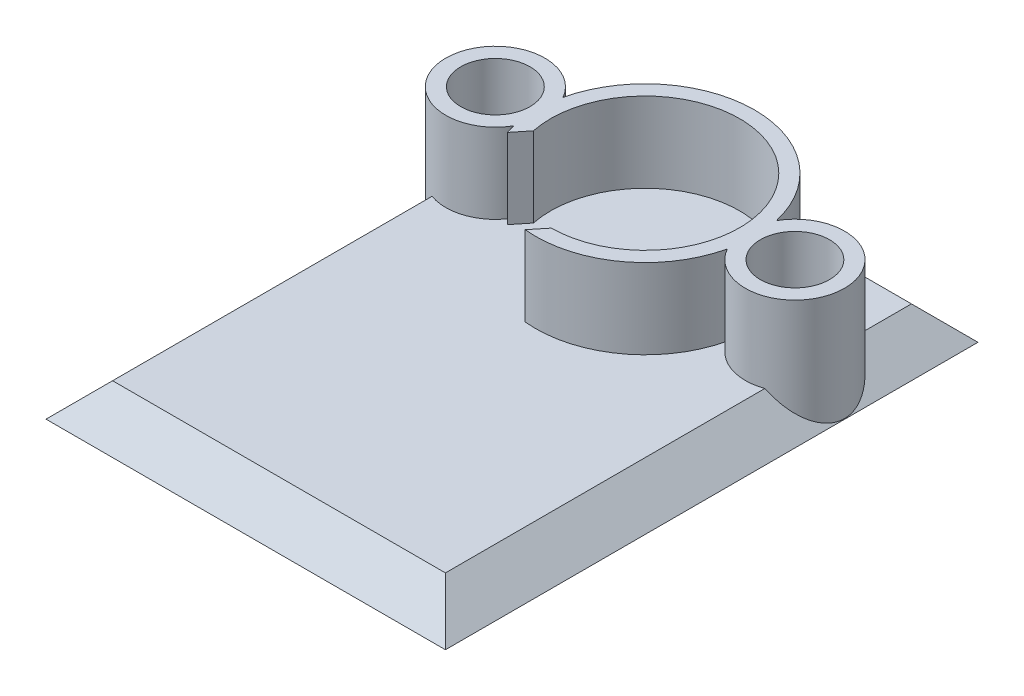
ISO-10303-21;
HEADER;
FILE_DESCRIPTION(('STEP AP214'),'2;1');
FILE_NAME('part.step','',(''),(''),'','','');
FILE_SCHEMA(('AUTOMOTIVE_DESIGN { 1 0 10303 214 1 1 1 1 }'));
ENDSEC;
DATA;
#1=APPLICATION_CONTEXT('core data for automotive mechanical design processes');
#2=APPLICATION_PROTOCOL_DEFINITION('international standard','automotive_design',2000,#1);
#3=PRODUCT_CONTEXT('',#1,'mechanical');
#4=PRODUCT('Part','Part','',(#3));
#5=PRODUCT_RELATED_PRODUCT_CATEGORY('part','',(#4));
#6=PRODUCT_DEFINITION_FORMATION('','',#4);
#7=PRODUCT_DEFINITION_CONTEXT('part definition',#1,'design');
#8=PRODUCT_DEFINITION('design','',#6,#7);
#9=PRODUCT_DEFINITION_SHAPE('','',#8);
#10=(LENGTH_UNIT() NAMED_UNIT(*) SI_UNIT(.MILLI.,.METRE.));
#11=(NAMED_UNIT(*) PLANE_ANGLE_UNIT() SI_UNIT($,.RADIAN.));
#12=(NAMED_UNIT(*) SI_UNIT($,.STERADIAN.) SOLID_ANGLE_UNIT());
#13=UNCERTAINTY_MEASURE_WITH_UNIT(LENGTH_MEASURE(1.E-05),#10,'distance_accuracy_value','');
#14=(GEOMETRIC_REPRESENTATION_CONTEXT(3) GLOBAL_UNCERTAINTY_ASSIGNED_CONTEXT((#13)) GLOBAL_UNIT_ASSIGNED_CONTEXT((#10,
#11,#12)) REPRESENTATION_CONTEXT('',''));
#15=CARTESIAN_POINT('',(0.,0.,0.));
#16=DIRECTION('',(0.,0.,1.));
#17=DIRECTION('',(1.,0.,0.));
#18=AXIS2_PLACEMENT_3D('',#15,#16,#17);
#19=CARTESIAN_POINT('',(0.,0.,0.));
#20=DIRECTION('',(0.,-1.,0.));
#21=DIRECTION('',(0.,0.,-1.));
#22=AXIS2_PLACEMENT_3D('',#19,#20,#21);
#23=PLANE('',#22);
#24=DIRECTION('',(0.,0.,-1.));
#25=VECTOR('',#24,1.);
#26=CARTESIAN_POINT('',(25.,0.,-40.));
#27=LINE('',#26,#25);
#28=CARTESIAN_POINT('',(25.,0.,-27.0180125391738));
#29=VERTEX_POINT('',#28);
#30=CARTESIAN_POINT('',(25.,0.,-35.));
#31=VERTEX_POINT('',#30);
#32=EDGE_CURVE('E55',#29,#31,#27,.T.);
#33=ORIENTED_EDGE('',*,*,#32,.T.);
#34=DIRECTION('',(-1.,0.,0.));
#35=VECTOR('',#34,1.);
#36=CARTESIAN_POINT('',(0.,0.,-35.));
#37=LINE('',#36,#35);
#38=CARTESIAN_POINT('',(6.7529623129409,0.,-35.));
#39=VERTEX_POINT('',#38);
#40=EDGE_CURVE('E205',#31,#39,#37,.T.);
#41=ORIENTED_EDGE('',*,*,#40,.T.);
#42=CARTESIAN_POINT('',(0.,0.,-20.));
#43=DIRECTION('',(0.,1.,0.));
#44=DIRECTION('',(0.,0.,1.));
#45=AXIS2_PLACEMENT_3D('',#42,#43,#44);
#46=CIRCLE('',#45,16.45);
#47=CARTESIAN_POINT('',(16.03,0.,-23.6934536683164));
#48=VERTEX_POINT('',#47);
#49=EDGE_CURVE('E247',#48,#39,#46,.T.);
#50=ORIENTED_EDGE('',*,*,#49,.F.);
#51=CARTESIAN_POINT('',(22.5,0.,-20.));
#52=DIRECTION('',(0.,1.,0.));
#53=DIRECTION('',(0.,0.,1.));
#54=AXIS2_PLACEMENT_3D('',#51,#52,#53);
#55=CIRCLE('',#54,7.45);
#56=EDGE_CURVE('E243',#29,#48,#55,.T.);
#57=ORIENTED_EDGE('',*,*,#56,.F.);
#58=EDGE_LOOP('',(#33,#41,#50,#57));
#59=FACE_BOUND('',#58,.T.);
#60=ADVANCED_FACE('F38',(#59),#23,.F.);
#61=CARTESIAN_POINT('',(-6.75296231294093,0.,-35.));
#62=VERTEX_POINT('',#61);
#63=CARTESIAN_POINT('',(-16.03,0.,-23.6934536683164));
#64=VERTEX_POINT('',#63);
#65=EDGE_CURVE('E233',#62,#64,#46,.T.);
#66=ORIENTED_EDGE('',*,*,#65,.F.);
#67=DIRECTION('',(-1.,0.,0.));
#68=VECTOR('',#67,1.);
#69=CARTESIAN_POINT('',(0.,0.,-35.));
#70=LINE('',#69,#68);
#71=CARTESIAN_POINT('',(-25.,0.,-35.));
#72=VERTEX_POINT('',#71);
#73=EDGE_CURVE('E63',#62,#72,#70,.T.);
#74=ORIENTED_EDGE('',*,*,#73,.T.);
#75=DIRECTION('',(0.,0.,1.));
#76=VECTOR('',#75,1.);
#77=CARTESIAN_POINT('',(-25.,0.,0.));
#78=LINE('',#77,#76);
#79=CARTESIAN_POINT('',(-25.,0.,-27.0180125391738));
#80=VERTEX_POINT('',#79);
#81=EDGE_CURVE('E201',#72,#80,#78,.T.);
#82=ORIENTED_EDGE('',*,*,#81,.T.);
#83=CARTESIAN_POINT('',(-22.5,0.,-20.));
#84=DIRECTION('',(0.,1.,0.));
#85=DIRECTION('',(0.,0.,1.));
#86=AXIS2_PLACEMENT_3D('',#83,#84,#85);
#87=CIRCLE('',#86,7.45);
#88=EDGE_CURVE('E224',#64,#80,#87,.T.);
#89=ORIENTED_EDGE('',*,*,#88,.F.);
#90=EDGE_LOOP('',(#66,#74,#82,#89));
#91=FACE_BOUND('',#90,.T.);
#92=ADVANCED_FACE('F316',(#91),#23,.F.);
#93=CARTESIAN_POINT('',(0.,-4.99999999999999,0.));
#94=DIRECTION('',(0.,-1.,0.));
#95=DIRECTION('',(0.,0.,-1.));
#96=AXIS2_PLACEMENT_3D('',#93,#94,#95);
#97=PLANE('',#96);
#98=DIRECTION('',(0.,0.,-1.));
#99=VECTOR('',#98,1.);
#100=CARTESIAN_POINT('',(-30.,-4.99999999999999,40.));
#101=LINE('',#100,#99);
#102=CARTESIAN_POINT('',(-30.,-4.99999999999999,40.));
#103=VERTEX_POINT('',#102);
#104=CARTESIAN_POINT('',(-30.,-4.99999999999999,-40.));
#105=VERTEX_POINT('',#104);
#106=EDGE_CURVE('E179',#103,#105,#101,.T.);
#107=ORIENTED_EDGE('',*,*,#106,.T.);
#108=DIRECTION('',(1.,0.,0.));
#109=VECTOR('',#108,1.);
#110=CARTESIAN_POINT('',(-30.,-4.99999999999999,-40.));
#111=LINE('',#110,#109);
#112=CARTESIAN_POINT('',(30.,-4.99999999999999,-40.));
#113=VERTEX_POINT('',#112);
#114=EDGE_CURVE('E181',#105,#113,#111,.T.);
#115=ORIENTED_EDGE('',*,*,#114,.T.);
#116=DIRECTION('',(0.,0.,-1.));
#117=VECTOR('',#116,1.);
#118=CARTESIAN_POINT('',(30.,-4.99999999999999,40.));
#119=LINE('',#118,#117);
#120=CARTESIAN_POINT('',(30.,-4.99999999999999,40.));
#121=VERTEX_POINT('',#120);
#122=EDGE_CURVE('E189',#121,#113,#119,.T.);
#123=ORIENTED_EDGE('',*,*,#122,.F.);
#124=DIRECTION('',(1.,0.,0.));
#125=VECTOR('',#124,1.);
#126=CARTESIAN_POINT('',(-30.,-4.99999999999999,40.));
#127=LINE('',#126,#125);
#128=EDGE_CURVE('E192',#103,#121,#127,.T.);
#129=ORIENTED_EDGE('',*,*,#128,.F.);
#130=EDGE_LOOP('',(#107,#115,#123,#129));
#131=FACE_BOUND('',#130,.T.);
#132=ADVANCED_FACE('F318',(#131),#97,.T.);
#133=DIRECTION('',(1.,0.,0.));
#134=VECTOR('',#133,1.);
#135=CARTESIAN_POINT('',(30.,0.,35.));
#136=LINE('',#135,#134);
#137=CARTESIAN_POINT('',(-25.,0.,35.));
#138=VERTEX_POINT('',#137);
#139=CARTESIAN_POINT('',(25.,0.,35.));
#140=VERTEX_POINT('',#139);
#141=EDGE_CURVE('E197',#138,#140,#136,.T.);
#142=ORIENTED_EDGE('',*,*,#141,.T.);
#143=DIRECTION('',(0.,0.,-1.));
#144=VECTOR('',#143,1.);
#145=CARTESIAN_POINT('',(25.,0.,-40.));
#146=LINE('',#145,#144);
#147=CARTESIAN_POINT('',(25.,0.,-12.9819874608263));
#148=VERTEX_POINT('',#147);
#149=EDGE_CURVE('E199',#140,#148,#146,.T.);
#150=ORIENTED_EDGE('',*,*,#149,.T.);
#151=CARTESIAN_POINT('',(16.03,0.,-16.3065463316836));
#152=VERTEX_POINT('',#151);
#153=EDGE_CURVE('E240',#152,#148,#55,.T.);
#154=ORIENTED_EDGE('',*,*,#153,.F.);
#155=CARTESIAN_POINT('',(-1.65953563684607,0.,-3.63392406622652));
#156=VERTEX_POINT('',#155);
#157=EDGE_CURVE('E234',#156,#152,#46,.T.);
#158=ORIENTED_EDGE('',*,*,#157,.F.);
#159=DIRECTION('',(0.628766779390763,0.,-0.777593941035144));
#160=VECTOR('',#159,1.);
#161=CARTESIAN_POINT('',(-2.78015929025246,0.,-2.24805224279177));
#162=LINE('',#161,#160);
#163=CARTESIAN_POINT('',(0.092207471268051,0.,-5.80029937702053));
#164=VERTEX_POINT('',#163);
#165=EDGE_CURVE('E238',#156,#164,#162,.T.);
#166=ORIENTED_EDGE('',*,*,#165,.T.);
#167=CARTESIAN_POINT('',(0.,0.,-20.));
#168=DIRECTION('',(0.,1.,0.));
#169=DIRECTION('',(0.,0.,1.));
#170=AXIS2_PLACEMENT_3D('',#167,#168,#169);
#171=CIRCLE('',#170,14.2);
#172=CARTESIAN_POINT('',(-13.9044834673646,0.,-17.1181014060543));
#173=VERTEX_POINT('',#172);
#174=EDGE_CURVE('E236',#164,#173,#171,.T.);
#175=ORIENTED_EDGE('',*,*,#174,.T.);
#176=DIRECTION('',(-0.628766779390764,0.,0.777593941035144));
#177=VECTOR('',#176,1.);
#178=CARTESIAN_POINT('',(-16.7768502288851,0.,-13.5658542718256));
#179=LINE('',#178,#177);
#180=CARTESIAN_POINT('',(-15.6562265754787,0.,-14.9517260952603));
#181=VERTEX_POINT('',#180);
#182=EDGE_CURVE('E232',#173,#181,#179,.T.);
#183=ORIENTED_EDGE('',*,*,#182,.T.);
#184=CARTESIAN_POINT('',(-16.03,0.,-16.3065463316836));
#185=VERTEX_POINT('',#184);
#186=EDGE_CURVE('E226',#185,#181,#46,.T.);
#187=ORIENTED_EDGE('',*,*,#186,.F.);
#188=CARTESIAN_POINT('',(-25.,0.,-12.9819874608262));
#189=VERTEX_POINT('',#188);
#190=EDGE_CURVE('E177',#189,#185,#87,.T.);
#191=ORIENTED_EDGE('',*,*,#190,.F.);
#192=DIRECTION('',(0.,0.,1.));
#193=VECTOR('',#192,1.);
#194=CARTESIAN_POINT('',(-25.,0.,0.));
#195=LINE('',#194,#193);
#196=EDGE_CURVE('E195',#189,#138,#195,.T.);
#197=ORIENTED_EDGE('',*,*,#196,.T.);
#198=EDGE_LOOP('',(#142,#150,#154,#158,#166,#175,#183,#187,#191,#197));
#199=FACE_BOUND('',#198,.T.);
#200=ADVANCED_FACE('F274',(#199),#23,.F.);
#201=CARTESIAN_POINT('',(-22.5,12.,-20.));
#202=DIRECTION('',(0.,-1.,0.));
#203=DIRECTION('',(0.,0.,-1.));
#204=AXIS2_PLACEMENT_3D('',#201,#202,#203);
#205=CYLINDRICAL_SURFACE('',#204,7.45);
#206=ORIENTED_EDGE('',*,*,#88,.T.);
#207=CARTESIAN_POINT('',(-22.5,2.49999999999997,-20.));
#208=DIRECTION('',(0.707106781186546,-0.707106781186549,0.));
#209=DIRECTION('',(-0.707106781186549,-0.707106781186546,0.));
#210=AXIS2_PLACEMENT_3D('',#207,#208,#209);
#211=ELLIPSE('',#210,10.5358910396795,7.45);
#212=EDGE_CURVE('E11',#80,#189,#211,.F.);
#213=ORIENTED_EDGE('',*,*,#212,.T.);
#214=ORIENTED_EDGE('',*,*,#190,.T.);
#215=DIRECTION('',(0.,-1.,0.));
#216=VECTOR('',#215,1.);
#217=CARTESIAN_POINT('',(-16.03,12.,-16.3065463316836));
#218=LINE('',#217,#216);
#219=CARTESIAN_POINT('',(-16.03,12.,-16.3065463316836));
#220=VERTEX_POINT('',#219);
#221=EDGE_CURVE('E154',#220,#185,#218,.T.);
#222=ORIENTED_EDGE('',*,*,#221,.F.);
#223=CARTESIAN_POINT('',(-22.5,12.,-20.));
#224=DIRECTION('',(0.,1.,0.));
#225=DIRECTION('',(0.,0.,1.));
#226=AXIS2_PLACEMENT_3D('',#223,#224,#225);
#227=CIRCLE('',#226,7.45);
#228=CARTESIAN_POINT('',(-16.03,12.,-23.6934536683164));
#229=VERTEX_POINT('',#228);
#230=EDGE_CURVE('E161',#229,#220,#227,.T.);
#231=ORIENTED_EDGE('',*,*,#230,.F.);
#232=DIRECTION('',(0.,-1.,0.));
#233=VECTOR('',#232,1.);
#234=CARTESIAN_POINT('',(-16.03,12.,-23.6934536683164));
#235=LINE('',#234,#233);
#236=EDGE_CURVE('E250',#229,#64,#235,.T.);
#237=ORIENTED_EDGE('',*,*,#236,.T.);
#238=EDGE_LOOP('',(#206,#213,#214,#222,#231,#237));
#239=FACE_BOUND('',#238,.T.);
#240=ADVANCED_FACE('F175',(#239),#205,.T.);
#241=CARTESIAN_POINT('',(0.,12.,-20.));
#242=DIRECTION('',(0.,-1.,0.));
#243=DIRECTION('',(0.,0.,-1.));
#244=AXIS2_PLACEMENT_3D('',#241,#242,#243);
#245=CYLINDRICAL_SURFACE('',#244,16.45);
#246=ORIENTED_EDGE('',*,*,#186,.T.);
#247=DIRECTION('',(0.,-1.,0.));
#248=VECTOR('',#247,1.);
#249=CARTESIAN_POINT('',(-15.6562265754787,12.,-14.9517260952603));
#250=LINE('',#249,#248);
#251=CARTESIAN_POINT('',(-15.6562265754787,12.,-14.9517260952603));
#252=VERTEX_POINT('',#251);
#253=EDGE_CURVE('E156',#252,#181,#250,.T.);
#254=ORIENTED_EDGE('',*,*,#253,.F.);
#255=CARTESIAN_POINT('',(0.,12.,-20.));
#256=DIRECTION('',(0.,1.,0.));
#257=DIRECTION('',(0.,0.,1.));
#258=AXIS2_PLACEMENT_3D('',#255,#256,#257);
#259=CIRCLE('',#258,16.45);
#260=EDGE_CURVE('E149',#220,#252,#259,.T.);
#261=ORIENTED_EDGE('',*,*,#260,.F.);
#262=ORIENTED_EDGE('',*,*,#221,.T.);
#263=EDGE_LOOP('',(#246,#254,#261,#262));
#264=FACE_BOUND('',#263,.T.);
#265=ADVANCED_FACE('F152',(#264),#245,.T.);
#266=CARTESIAN_POINT('',(-16.7768502288851,12.,-13.5658542718256));
#267=DIRECTION('',(0.777593941035144,0.,0.628766779390764));
#268=DIRECTION('',(0.628766779390764,0.,-0.777593941035144));
#269=AXIS2_PLACEMENT_3D('',#266,#267,#268);
#270=PLANE('',#269);
#271=ORIENTED_EDGE('',*,*,#182,.F.);
#272=DIRECTION('',(0.,-1.,0.));
#273=VECTOR('',#272,1.);
#274=CARTESIAN_POINT('',(-13.9044834673646,12.,-17.1181014060543));
#275=LINE('',#274,#273);
#276=CARTESIAN_POINT('',(-13.9044834673646,12.,-17.1181014060543));
#277=VERTEX_POINT('',#276);
#278=EDGE_CURVE('E183',#277,#173,#275,.T.);
#279=ORIENTED_EDGE('',*,*,#278,.F.);
#280=DIRECTION('',(-0.628766779390764,0.,0.777593941035144));
#281=VECTOR('',#280,1.);
#282=CARTESIAN_POINT('',(-16.7768502288851,12.,-13.5658542718256));
#283=LINE('',#282,#281);
#284=EDGE_CURVE('E160',#277,#252,#283,.T.);
#285=ORIENTED_EDGE('',*,*,#284,.T.);
#286=ORIENTED_EDGE('',*,*,#253,.T.);
#287=EDGE_LOOP('',(#271,#279,#285,#286));
#288=FACE_BOUND('',#287,.T.);
#289=ADVANCED_FACE('F272',(#288),#270,.T.);
#290=CARTESIAN_POINT('',(0.,12.,-20.));
#291=DIRECTION('',(0.,-1.,0.));
#292=DIRECTION('',(0.,0.,-1.));
#293=AXIS2_PLACEMENT_3D('',#290,#291,#292);
#294=CYLINDRICAL_SURFACE('',#293,14.2);
#295=ORIENTED_EDGE('',*,*,#174,.F.);
#296=DIRECTION('',(0.,-1.,0.));
#297=VECTOR('',#296,1.);
#298=CARTESIAN_POINT('',(0.092207471268051,12.,-5.80029937702053));
#299=LINE('',#298,#297);
#300=CARTESIAN_POINT('',(0.092207471268051,12.,-5.80029937702053));
#301=VERTEX_POINT('',#300);
#302=EDGE_CURVE('E261',#301,#164,#299,.T.);
#303=ORIENTED_EDGE('',*,*,#302,.F.);
#304=CARTESIAN_POINT('',(0.,12.,-20.));
#305=DIRECTION('',(0.,1.,0.));
#306=DIRECTION('',(0.,0.,1.));
#307=AXIS2_PLACEMENT_3D('',#304,#305,#306);
#308=CIRCLE('',#307,14.2);
#309=EDGE_CURVE('E270',#301,#277,#308,.T.);
#310=ORIENTED_EDGE('',*,*,#309,.T.);
#311=ORIENTED_EDGE('',*,*,#278,.T.);
#312=EDGE_LOOP('',(#295,#303,#310,#311));
#313=FACE_BOUND('',#312,.T.);
#314=ADVANCED_FACE('F268',(#313),#294,.F.);
#315=CARTESIAN_POINT('',(-2.78015929025246,12.,-2.24805224279177));
#316=DIRECTION('',(-0.777593941035144,0.,-0.628766779390763));
#317=DIRECTION('',(-0.628766779390763,0.,0.777593941035144));
#318=AXIS2_PLACEMENT_3D('',#315,#316,#317);
#319=PLANE('',#318);
#320=ORIENTED_EDGE('',*,*,#165,.F.);
#321=DIRECTION('',(0.,-1.,0.));
#322=VECTOR('',#321,1.);
#323=CARTESIAN_POINT('',(-1.65953563684607,12.,-3.63392406622652));
#324=LINE('',#323,#322);
#325=CARTESIAN_POINT('',(-1.65953563684607,12.,-3.63392406622652));
#326=VERTEX_POINT('',#325);
#327=EDGE_CURVE('E258',#326,#156,#324,.T.);
#328=ORIENTED_EDGE('',*,*,#327,.F.);
#329=DIRECTION('',(0.628766779390763,0.,-0.777593941035144));
#330=VECTOR('',#329,1.);
#331=CARTESIAN_POINT('',(-2.78015929025246,12.,-2.24805224279177));
#332=LINE('',#331,#330);
#333=EDGE_CURVE('E281',#326,#301,#332,.T.);
#334=ORIENTED_EDGE('',*,*,#333,.T.);
#335=ORIENTED_EDGE('',*,*,#302,.T.);
#336=EDGE_LOOP('',(#320,#328,#334,#335));
#337=FACE_BOUND('',#336,.T.);
#338=ADVANCED_FACE('F279',(#337),#319,.T.);
#339=ORIENTED_EDGE('',*,*,#157,.T.);
#340=DIRECTION('',(0.,-1.,0.));
#341=VECTOR('',#340,1.);
#342=CARTESIAN_POINT('',(16.03,12.,-16.3065463316836));
#343=LINE('',#342,#341);
#344=CARTESIAN_POINT('',(16.03,12.,-16.3065463316836));
#345=VERTEX_POINT('',#344);
#346=EDGE_CURVE('E255',#345,#152,#343,.T.);
#347=ORIENTED_EDGE('',*,*,#346,.F.);
#348=EDGE_CURVE('E164',#326,#345,#259,.T.);
#349=ORIENTED_EDGE('',*,*,#348,.F.);
#350=ORIENTED_EDGE('',*,*,#327,.T.);
#351=EDGE_LOOP('',(#339,#347,#349,#350));
#352=FACE_BOUND('',#351,.T.);
#353=ADVANCED_FACE('F297',(#352),#245,.T.);
#354=CARTESIAN_POINT('',(22.5,12.,-20.));
#355=DIRECTION('',(0.,-1.,0.));
#356=DIRECTION('',(0.,0.,-1.));
#357=AXIS2_PLACEMENT_3D('',#354,#355,#356);
#358=CYLINDRICAL_SURFACE('',#357,7.45);
#359=ORIENTED_EDGE('',*,*,#153,.T.);
#360=CARTESIAN_POINT('',(22.5,2.5,-20.));
#361=DIRECTION('',(0.707106781186546,0.707106781186549,0.));
#362=DIRECTION('',(0.707106781186549,-0.707106781186546,0.));
#363=AXIS2_PLACEMENT_3D('',#360,#361,#362);
#364=ELLIPSE('',#363,10.5358910396795,7.45);
#365=EDGE_CURVE('E47',#148,#29,#364,.T.);
#366=ORIENTED_EDGE('',*,*,#365,.T.);
#367=ORIENTED_EDGE('',*,*,#56,.T.);
#368=DIRECTION('',(0.,-1.,0.));
#369=VECTOR('',#368,1.);
#370=CARTESIAN_POINT('',(16.03,12.,-23.6934536683164));
#371=LINE('',#370,#369);
#372=CARTESIAN_POINT('',(16.03,12.,-23.6934536683164));
#373=VERTEX_POINT('',#372);
#374=EDGE_CURVE('E252',#373,#48,#371,.T.);
#375=ORIENTED_EDGE('',*,*,#374,.F.);
#376=CARTESIAN_POINT('',(22.5,12.,-20.));
#377=DIRECTION('',(0.,1.,0.));
#378=DIRECTION('',(0.,0.,1.));
#379=AXIS2_PLACEMENT_3D('',#376,#377,#378);
#380=CIRCLE('',#379,7.45);
#381=EDGE_CURVE('E286',#345,#373,#380,.T.);
#382=ORIENTED_EDGE('',*,*,#381,.F.);
#383=ORIENTED_EDGE('',*,*,#346,.T.);
#384=EDGE_LOOP('',(#359,#366,#367,#375,#382,#383));
#385=FACE_BOUND('',#384,.T.);
#386=ADVANCED_FACE('F299',(#385),#358,.T.);
#387=CARTESIAN_POINT('',(-22.5,12.,-20.));
#388=DIRECTION('',(0.,-1.,0.));
#389=DIRECTION('',(0.,0.,-1.));
#390=AXIS2_PLACEMENT_3D('',#387,#388,#389);
#391=CYLINDRICAL_SURFACE('',#390,5.2);
#392=CARTESIAN_POINT('',(-22.5,12.,-20.));
#393=DIRECTION('',(0.,1.,0.));
#394=DIRECTION('',(0.,0.,1.));
#395=AXIS2_PLACEMENT_3D('',#392,#393,#394);
#396=CIRCLE('',#395,5.2);
#397=CARTESIAN_POINT('',(-22.5,12.,-14.8));
#398=VERTEX_POINT('',#397);
#399=EDGE_CURVE('E287',#398,#398,#396,.T.);
#400=ORIENTED_EDGE('',*,*,#399,.T.);
#401=EDGE_LOOP('',(#400));
#402=FACE_BOUND('',#401,.T.);
#403=CARTESIAN_POINT('',(-22.5,0.,-20.));
#404=DIRECTION('',(0.,1.,0.));
#405=DIRECTION('',(0.,0.,1.));
#406=AXIS2_PLACEMENT_3D('',#403,#404,#405);
#407=CIRCLE('',#406,5.2);
#408=CARTESIAN_POINT('',(-22.5,0.,-14.8));
#409=VERTEX_POINT('',#408);
#410=EDGE_CURVE('E244',#409,#409,#407,.T.);
#411=ORIENTED_EDGE('',*,*,#410,.F.);
#412=EDGE_LOOP('',(#411));
#413=FACE_BOUND('',#412,.T.);
#414=ADVANCED_FACE('F359',(#402,#413),#391,.F.);
#415=ORIENTED_EDGE('',*,*,#49,.T.);
#416=CARTESIAN_POINT('',(0.,14.9999999999999,-20.));
#417=DIRECTION('',(0.,-0.707106781186549,0.707106781186546));
#418=DIRECTION('',(0.,-0.707106781186546,-0.707106781186549));
#419=AXIS2_PLACEMENT_3D('',#416,#417,#418);
#420=ELLIPSE('',#419,23.2638131010374,16.45);
#421=EDGE_CURVE('E207',#39,#62,#420,.F.);
#422=ORIENTED_EDGE('',*,*,#421,.T.);
#423=ORIENTED_EDGE('',*,*,#65,.T.);
#424=ORIENTED_EDGE('',*,*,#236,.F.);
#425=EDGE_CURVE('E163',#373,#229,#259,.T.);
#426=ORIENTED_EDGE('',*,*,#425,.F.);
#427=ORIENTED_EDGE('',*,*,#374,.T.);
#428=EDGE_LOOP('',(#415,#422,#423,#424,#426,#427));
#429=FACE_BOUND('',#428,.T.);
#430=ADVANCED_FACE('F303',(#429),#245,.T.);
#431=CARTESIAN_POINT('',(22.5,12.,-20.));
#432=DIRECTION('',(0.,-1.,0.));
#433=DIRECTION('',(0.,0.,-1.));
#434=AXIS2_PLACEMENT_3D('',#431,#432,#433);
#435=CYLINDRICAL_SURFACE('',#434,5.2);
#436=CARTESIAN_POINT('',(22.5,12.,-20.));
#437=DIRECTION('',(0.,1.,0.));
#438=DIRECTION('',(0.,0.,1.));
#439=AXIS2_PLACEMENT_3D('',#436,#437,#438);
#440=CIRCLE('',#439,5.2);
#441=CARTESIAN_POINT('',(22.5,12.,-14.8));
#442=VERTEX_POINT('',#441);
#443=EDGE_CURVE('E229',#442,#442,#440,.T.);
#444=ORIENTED_EDGE('',*,*,#443,.T.);
#445=EDGE_LOOP('',(#444));
#446=FACE_BOUND('',#445,.T.);
#447=CARTESIAN_POINT('',(22.5,0.,-20.));
#448=DIRECTION('',(0.,1.,0.));
#449=DIRECTION('',(0.,0.,1.));
#450=AXIS2_PLACEMENT_3D('',#447,#448,#449);
#451=CIRCLE('',#450,5.2);
#452=CARTESIAN_POINT('',(22.5,0.,-14.8));
#453=VERTEX_POINT('',#452);
#454=EDGE_CURVE('E172',#453,#453,#451,.T.);
#455=ORIENTED_EDGE('',*,*,#454,.F.);
#456=EDGE_LOOP('',(#455));
#457=FACE_BOUND('',#456,.T.);
#458=ADVANCED_FACE('F350',(#446,#457),#435,.F.);
#459=CARTESIAN_POINT('',(0.,12.,0.));
#460=DIRECTION('',(0.,1.,0.));
#461=DIRECTION('',(0.,0.,1.));
#462=AXIS2_PLACEMENT_3D('',#459,#460,#461);
#463=PLANE('',#462);
#464=ORIENTED_EDGE('',*,*,#230,.T.);
#465=ORIENTED_EDGE('',*,*,#260,.T.);
#466=ORIENTED_EDGE('',*,*,#284,.F.);
#467=ORIENTED_EDGE('',*,*,#309,.F.);
#468=ORIENTED_EDGE('',*,*,#333,.F.);
#469=ORIENTED_EDGE('',*,*,#348,.T.);
#470=ORIENTED_EDGE('',*,*,#381,.T.);
#471=ORIENTED_EDGE('',*,*,#425,.T.);
#472=EDGE_LOOP('',(#464,#465,#466,#467,#468,#469,#470,#471));
#473=FACE_BOUND('',#472,.T.);
#474=ORIENTED_EDGE('',*,*,#399,.F.);
#475=EDGE_LOOP('',(#474));
#476=FACE_BOUND('',#475,.T.);
#477=ORIENTED_EDGE('',*,*,#443,.F.);
#478=EDGE_LOOP('',(#477));
#479=FACE_BOUND('',#478,.T.);
#480=ADVANCED_FACE('F166',(#473,#476,#479),#463,.T.);
#481=ORIENTED_EDGE('',*,*,#410,.T.);
#482=EDGE_LOOP('',(#481));
#483=FACE_BOUND('',#482,.T.);
#484=ADVANCED_FACE('F327',(#483),#23,.F.);
#485=ORIENTED_EDGE('',*,*,#454,.T.);
#486=EDGE_LOOP('',(#485));
#487=FACE_BOUND('',#486,.T.);
#488=ADVANCED_FACE('F326',(#487),#23,.F.);
#489=CARTESIAN_POINT('',(0.,0.,35.));
#490=DIRECTION('',(0.,0.707106781186549,0.707106781186546));
#491=DIRECTION('',(-1.,0.,0.));
#492=AXIS2_PLACEMENT_3D('',#489,#490,#491);
#493=PLANE('',#492);
#494=DIRECTION('',(-0.577350269189627,0.577350269189624,-0.577350269189627));
#495=VECTOR('',#494,1.);
#496=CARTESIAN_POINT('',(16.6666666666666,8.33333333333332,26.6666666666667));
#497=LINE('',#496,#495);
#498=EDGE_CURVE('E214',#140,#121,#497,.F.);
#499=ORIENTED_EDGE('',*,*,#498,.F.);
#500=ORIENTED_EDGE('',*,*,#141,.F.);
#501=DIRECTION('',(-0.577350269189627,-0.577350269189624,0.577350269189627));
#502=VECTOR('',#501,1.);
#503=CARTESIAN_POINT('',(-30.,-4.99999999999999,40.));
#504=LINE('',#503,#502);
#505=EDGE_CURVE('E42',#103,#138,#504,.F.);
#506=ORIENTED_EDGE('',*,*,#505,.F.);
#507=ORIENTED_EDGE('',*,*,#128,.T.);
#508=EDGE_LOOP('',(#499,#500,#506,#507));
#509=FACE_BOUND('',#508,.T.);
#510=ADVANCED_FACE('F40',(#509),#493,.T.);
#511=CARTESIAN_POINT('',(-30.,-4.99999999999999,40.));
#512=DIRECTION('',(0.707106781186546,-0.707106781186549,0.));
#513=DIRECTION('',(0.,0.,-1.));
#514=AXIS2_PLACEMENT_3D('',#511,#512,#513);
#515=PLANE('',#514);
#516=ORIENTED_EDGE('',*,*,#212,.F.);
#517=ORIENTED_EDGE('',*,*,#81,.F.);
#518=DIRECTION('',(-0.577350269189627,-0.577350269189624,-0.577350269189627));
#519=VECTOR('',#518,1.);
#520=CARTESIAN_POINT('',(-3.33333333333327,21.6666666666667,-13.3333333333333));
#521=LINE('',#520,#519);
#522=EDGE_CURVE('E212',#105,#72,#521,.F.);
#523=ORIENTED_EDGE('',*,*,#522,.F.);
#524=ORIENTED_EDGE('',*,*,#106,.F.);
#525=ORIENTED_EDGE('',*,*,#505,.T.);
#526=ORIENTED_EDGE('',*,*,#196,.F.);
#527=EDGE_LOOP('',(#516,#517,#523,#524,#525,#526));
#528=FACE_BOUND('',#527,.T.);
#529=ADVANCED_FACE('F306',(#528),#515,.F.);
#530=CARTESIAN_POINT('',(25.,0.,0.));
#531=DIRECTION('',(0.707106781186546,0.707106781186549,0.));
#532=DIRECTION('',(0.,0.,1.));
#533=AXIS2_PLACEMENT_3D('',#530,#531,#532);
#534=PLANE('',#533);
#535=ORIENTED_EDGE('',*,*,#498,.T.);
#536=ORIENTED_EDGE('',*,*,#122,.T.);
#537=DIRECTION('',(0.577350269189627,-0.577350269189624,-0.577350269189627));
#538=VECTOR('',#537,1.);
#539=CARTESIAN_POINT('',(13.3333333333333,11.6666666666666,-23.3333333333333));
#540=LINE('',#539,#538);
#541=EDGE_CURVE('E210',#31,#113,#540,.T.);
#542=ORIENTED_EDGE('',*,*,#541,.F.);
#543=ORIENTED_EDGE('',*,*,#32,.F.);
#544=ORIENTED_EDGE('',*,*,#365,.F.);
#545=ORIENTED_EDGE('',*,*,#149,.F.);
#546=EDGE_LOOP('',(#535,#536,#542,#543,#544,#545));
#547=FACE_BOUND('',#546,.T.);
#548=ADVANCED_FACE('F311',(#547),#534,.T.);
#549=CARTESIAN_POINT('',(-30.,-4.99999999999999,-40.));
#550=DIRECTION('',(0.,-0.707106781186549,0.707106781186546));
#551=DIRECTION('',(1.,0.,0.));
#552=AXIS2_PLACEMENT_3D('',#549,#550,#551);
#553=PLANE('',#552);
#554=ORIENTED_EDGE('',*,*,#421,.F.);
#555=ORIENTED_EDGE('',*,*,#40,.F.);
#556=ORIENTED_EDGE('',*,*,#541,.T.);
#557=ORIENTED_EDGE('',*,*,#114,.F.);
#558=ORIENTED_EDGE('',*,*,#522,.T.);
#559=ORIENTED_EDGE('',*,*,#73,.F.);
#560=EDGE_LOOP('',(#554,#555,#556,#557,#558,#559));
#561=FACE_BOUND('',#560,.T.);
#562=ADVANCED_FACE('F315',(#561),#553,.F.);
#563=CLOSED_SHELL('',(#60,#92,#132,#200,#240,#265,#289,#314,#338,#353,#386,#414,#430,#458,#480,
#484,#488,#510,#529,#548,#562));
#564=MANIFOLD_SOLID_BREP('B2',#563);
#565=ADVANCED_BREP_SHAPE_REPRESENTATION('',(#18,#564),#14);
#566=SHAPE_DEFINITION_REPRESENTATION(#9,#565);
ENDSEC;
END-ISO-10303-21;
